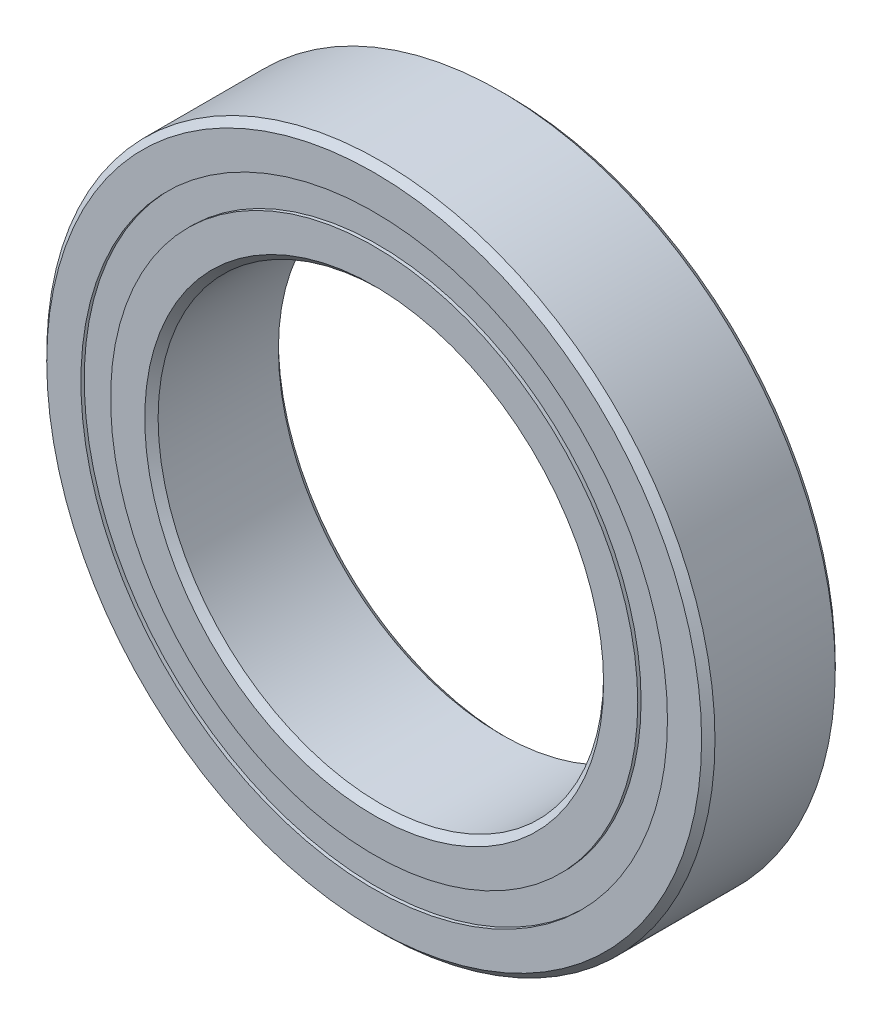
ISO-10303-21;
HEADER;
FILE_DESCRIPTION(('STEP AP214'),'2;1');
FILE_NAME('part.step','',(''),(''),'','','');
FILE_SCHEMA(('AUTOMOTIVE_DESIGN { 1 0 10303 214 1 1 1 1 }'));
ENDSEC;
DATA;
#1=APPLICATION_CONTEXT('core data for automotive mechanical design processes');
#2=APPLICATION_PROTOCOL_DEFINITION('international standard','automotive_design',2000,#1);
#3=PRODUCT_CONTEXT('',#1,'mechanical');
#4=PRODUCT('Part','Part','',(#3));
#5=PRODUCT_RELATED_PRODUCT_CATEGORY('part','',(#4));
#6=PRODUCT_DEFINITION_FORMATION('','',#4);
#7=PRODUCT_DEFINITION_CONTEXT('part definition',#1,'design');
#8=PRODUCT_DEFINITION('design','',#6,#7);
#9=PRODUCT_DEFINITION_SHAPE('','',#8);
#10=(LENGTH_UNIT() NAMED_UNIT(*) SI_UNIT(.MILLI.,.METRE.));
#11=(NAMED_UNIT(*) PLANE_ANGLE_UNIT() SI_UNIT($,.RADIAN.));
#12=(NAMED_UNIT(*) SI_UNIT($,.STERADIAN.) SOLID_ANGLE_UNIT());
#13=UNCERTAINTY_MEASURE_WITH_UNIT(LENGTH_MEASURE(1.E-05),#10,'distance_accuracy_value','');
#14=(GEOMETRIC_REPRESENTATION_CONTEXT(3) GLOBAL_UNCERTAINTY_ASSIGNED_CONTEXT((#13)) GLOBAL_UNIT_ASSIGNED_CONTEXT((#10,
#11,#12)) REPRESENTATION_CONTEXT('',''));
#15=CARTESIAN_POINT('',(0.,0.,0.));
#16=DIRECTION('',(0.,0.,1.));
#17=DIRECTION('',(1.,0.,0.));
#18=AXIS2_PLACEMENT_3D('',#15,#16,#17);
#19=CARTESIAN_POINT('',(0.,6.58333333333333,-0.745355992499933));
#20=DIRECTION('',(0.,0.,-1.));
#21=DIRECTION('',(-1.,0.,0.));
#22=AXIS2_PLACEMENT_3D('',#19,#20,#21);
#23=PLANE('',#22);
#24=CARTESIAN_POINT('',(0.,0.,-0.745355992499933));
#25=DIRECTION('',(0.,0.,1.));
#26=DIRECTION('',(1.,0.,0.));
#27=AXIS2_PLACEMENT_3D('',#24,#25,#26);
#28=CIRCLE('',#27,5.91666666666667);
#29=CARTESIAN_POINT('',(5.91666666666667,0.,-0.745355992499933));
#30=VERTEX_POINT('',#29);
#31=EDGE_CURVE('E11',#30,#30,#28,.T.);
#32=ORIENTED_EDGE('',*,*,#31,.F.);
#33=EDGE_LOOP('',(#32));
#34=FACE_BOUND('',#33,.T.);
#35=CARTESIAN_POINT('',(0.,0.,-0.745355992499933));
#36=DIRECTION('',(0.,0.,1.));
#37=DIRECTION('',(1.,0.,0.));
#38=AXIS2_PLACEMENT_3D('',#35,#36,#37);
#39=CIRCLE('',#38,6.58333333333333);
#40=CARTESIAN_POINT('',(6.58333333333333,0.,-0.745355992499933));
#41=VERTEX_POINT('',#40);
#42=EDGE_CURVE('E60',#41,#41,#39,.T.);
#43=ORIENTED_EDGE('',*,*,#42,.T.);
#44=EDGE_LOOP('',(#43));
#45=FACE_BOUND('',#44,.T.);
#46=ADVANCED_FACE('F46',(#34,#45),#23,.F.);
#47=CARTESIAN_POINT('',(0.,0.,1.5));
#48=DIRECTION('',(0.,0.,1.));
#49=DIRECTION('',(1.,0.,0.));
#50=AXIS2_PLACEMENT_3D('',#47,#48,#49);
#51=CYLINDRICAL_SURFACE('',#50,5.91666666666667);
#52=CARTESIAN_POINT('',(0.,0.,-1.42500000000001));
#53=DIRECTION('',(0.,0.,1.));
#54=DIRECTION('',(1.,0.,0.));
#55=AXIS2_PLACEMENT_3D('',#52,#53,#54);
#56=CIRCLE('',#55,5.91666666666667);
#57=CARTESIAN_POINT('',(5.91666666666667,0.,-1.42500000000001));
#58=VERTEX_POINT('',#57);
#59=EDGE_CURVE('E52',#58,#58,#56,.T.);
#60=ORIENTED_EDGE('',*,*,#59,.F.);
#61=EDGE_LOOP('',(#60));
#62=FACE_BOUND('',#61,.T.);
#63=ORIENTED_EDGE('',*,*,#31,.T.);
#64=EDGE_LOOP('',(#63));
#65=FACE_BOUND('',#64,.T.);
#66=ADVANCED_FACE('F75',(#62,#65),#51,.F.);
#67=CARTESIAN_POINT('',(0.,6.58333333333333,-1.42500000000001));
#68=DIRECTION('',(0.,0.,1.));
#69=DIRECTION('',(1.,0.,0.));
#70=AXIS2_PLACEMENT_3D('',#67,#68,#69);
#71=PLANE('',#70);
#72=CARTESIAN_POINT('',(0.,0.,-1.42500000000001));
#73=DIRECTION('',(0.,0.,1.));
#74=DIRECTION('',(1.,0.,0.));
#75=AXIS2_PLACEMENT_3D('',#72,#73,#74);
#76=CIRCLE('',#75,6.58333333333333);
#77=CARTESIAN_POINT('',(6.58333333333333,0.,-1.42500000000001));
#78=VERTEX_POINT('',#77);
#79=EDGE_CURVE('E56',#78,#78,#76,.T.);
#80=ORIENTED_EDGE('',*,*,#79,.F.);
#81=EDGE_LOOP('',(#80));
#82=FACE_BOUND('',#81,.T.);
#83=ORIENTED_EDGE('',*,*,#59,.T.);
#84=EDGE_LOOP('',(#83));
#85=FACE_BOUND('',#84,.T.);
#86=ADVANCED_FACE('F70',(#82,#85),#71,.F.);
#87=CARTESIAN_POINT('',(0.,0.,1.5));
#88=DIRECTION('',(0.,0.,1.));
#89=DIRECTION('',(1.,0.,0.));
#90=AXIS2_PLACEMENT_3D('',#87,#88,#89);
#91=CYLINDRICAL_SURFACE('',#90,6.58333333333333);
#92=ORIENTED_EDGE('',*,*,#42,.F.);
#93=EDGE_LOOP('',(#92));
#94=FACE_BOUND('',#93,.T.);
#95=ORIENTED_EDGE('',*,*,#79,.T.);
#96=EDGE_LOOP('',(#95));
#97=FACE_BOUND('',#96,.T.);
#98=ADVANCED_FACE('F67',(#94,#97),#91,.T.);
#99=CLOSED_SHELL('',(#46,#66,#86,#98));
#100=MANIFOLD_SOLID_BREP('B2',#99);
#101=CARTESIAN_POINT('',(0.,6.58333333333333,1.425));
#102=DIRECTION('',(0.,0.,-1.));
#103=DIRECTION('',(-1.,0.,0.));
#104=AXIS2_PLACEMENT_3D('',#101,#102,#103);
#105=PLANE('',#104);
#106=CARTESIAN_POINT('',(0.,0.,1.425));
#107=DIRECTION('',(0.,0.,1.));
#108=DIRECTION('',(1.,0.,0.));
#109=AXIS2_PLACEMENT_3D('',#106,#107,#108);
#110=CIRCLE('',#109,5.91666666666667);
#111=CARTESIAN_POINT('',(5.91666666666667,0.,1.425));
#112=VERTEX_POINT('',#111);
#113=EDGE_CURVE('E45',#112,#112,#110,.T.);
#114=ORIENTED_EDGE('',*,*,#113,.F.);
#115=EDGE_LOOP('',(#114));
#116=FACE_BOUND('',#115,.T.);
#117=CARTESIAN_POINT('',(0.,0.,1.425));
#118=DIRECTION('',(0.,0.,1.));
#119=DIRECTION('',(1.,0.,0.));
#120=AXIS2_PLACEMENT_3D('',#117,#118,#119);
#121=CIRCLE('',#120,6.58333333333333);
#122=CARTESIAN_POINT('',(6.58333333333333,0.,1.425));
#123=VERTEX_POINT('',#122);
#124=EDGE_CURVE('E128',#123,#123,#121,.T.);
#125=ORIENTED_EDGE('',*,*,#124,.T.);
#126=EDGE_LOOP('',(#125));
#127=FACE_BOUND('',#126,.T.);
#128=ADVANCED_FACE('F114',(#116,#127),#105,.F.);
#129=CARTESIAN_POINT('',(0.,0.,1.5));
#130=DIRECTION('',(0.,0.,1.));
#131=DIRECTION('',(1.,0.,0.));
#132=AXIS2_PLACEMENT_3D('',#129,#130,#131);
#133=CYLINDRICAL_SURFACE('',#132,5.91666666666667);
#134=CARTESIAN_POINT('',(0.,0.,0.745355992499925));
#135=DIRECTION('',(0.,0.,1.));
#136=DIRECTION('',(1.,0.,0.));
#137=AXIS2_PLACEMENT_3D('',#134,#135,#136);
#138=CIRCLE('',#137,5.91666666666667);
#139=CARTESIAN_POINT('',(5.91666666666667,0.,0.745355992499925));
#140=VERTEX_POINT('',#139);
#141=EDGE_CURVE('E120',#140,#140,#138,.T.);
#142=ORIENTED_EDGE('',*,*,#141,.F.);
#143=EDGE_LOOP('',(#142));
#144=FACE_BOUND('',#143,.T.);
#145=ORIENTED_EDGE('',*,*,#113,.T.);
#146=EDGE_LOOP('',(#145));
#147=FACE_BOUND('',#146,.T.);
#148=ADVANCED_FACE('F143',(#144,#147),#133,.F.);
#149=CARTESIAN_POINT('',(0.,6.58333333333333,0.745355992499925));
#150=DIRECTION('',(0.,0.,1.));
#151=DIRECTION('',(1.,0.,0.));
#152=AXIS2_PLACEMENT_3D('',#149,#150,#151);
#153=PLANE('',#152);
#154=CARTESIAN_POINT('',(0.,0.,0.745355992499925));
#155=DIRECTION('',(0.,0.,1.));
#156=DIRECTION('',(1.,0.,0.));
#157=AXIS2_PLACEMENT_3D('',#154,#155,#156);
#158=CIRCLE('',#157,6.58333333333333);
#159=CARTESIAN_POINT('',(6.58333333333333,0.,0.745355992499925));
#160=VERTEX_POINT('',#159);
#161=EDGE_CURVE('E124',#160,#160,#158,.T.);
#162=ORIENTED_EDGE('',*,*,#161,.F.);
#163=EDGE_LOOP('',(#162));
#164=FACE_BOUND('',#163,.T.);
#165=ORIENTED_EDGE('',*,*,#141,.T.);
#166=EDGE_LOOP('',(#165));
#167=FACE_BOUND('',#166,.T.);
#168=ADVANCED_FACE('F138',(#164,#167),#153,.F.);
#169=CARTESIAN_POINT('',(0.,0.,1.5));
#170=DIRECTION('',(0.,0.,1.));
#171=DIRECTION('',(1.,0.,0.));
#172=AXIS2_PLACEMENT_3D('',#169,#170,#171);
#173=CYLINDRICAL_SURFACE('',#172,6.58333333333333);
#174=ORIENTED_EDGE('',*,*,#124,.F.);
#175=EDGE_LOOP('',(#174));
#176=FACE_BOUND('',#175,.T.);
#177=ORIENTED_EDGE('',*,*,#161,.T.);
#178=EDGE_LOOP('',(#177));
#179=FACE_BOUND('',#178,.T.);
#180=ADVANCED_FACE('F135',(#176,#179),#173,.T.);
#181=CLOSED_SHELL('',(#128,#148,#168,#180));
#182=MANIFOLD_SOLID_BREP('B6',#181);
#183=CARTESIAN_POINT('',(-1.55431179478026,6.05364475705397,0.));
#184=DIRECTION('',(0.,0.,1.));
#185=DIRECTION('',(-0.248689887164842,0.968583161128635,0.));
#186=AXIS2_PLACEMENT_3D('',#183,#184,#185);
#187=SPHERICAL_SURFACE('',#186,0.745355992499925);
#188=CARTESIAN_POINT('',(-1.55431179478026,6.05364475705397,0.745355992499921));
#189=VERTEX_POINT('',#188);
#190=VERTEX_LOOP('',#189);
#191=FACE_BOUND('',#190,.T.);
#192=ADVANCED_FACE('F182',(#191),#187,.T.);
#193=CLOSED_SHELL('',(#192));
#194=MANIFOLD_SOLID_BREP('B40',#193);
#195=CARTESIAN_POINT('',(-3.01096046313565,5.47691675027419,0.));
#196=DIRECTION('',(0.,0.,1.));
#197=DIRECTION('',(-0.481753674101704,0.87630668004387,0.));
#198=AXIS2_PLACEMENT_3D('',#195,#196,#197);
#199=SPHERICAL_SURFACE('',#198,0.745355992499925);
#200=CARTESIAN_POINT('',(-3.01096046313565,5.47691675027419,0.745355992499921));
#201=VERTEX_POINT('',#200);
#202=VERTEX_LOOP('',#201);
#203=FACE_BOUND('',#202,.T.);
#204=ADVANCED_FACE('F201',(#203),#199,.T.);
#205=CLOSED_SHELL('',(#204));
#206=MANIFOLD_SOLID_BREP('B110',#205);
#207=CARTESIAN_POINT('',(-4.27841941205425,4.55605392138388,0.));
#208=DIRECTION('',(0.,0.,1.));
#209=DIRECTION('',(-0.684547105928679,0.72896862742142,0.));
#210=AXIS2_PLACEMENT_3D('',#207,#208,#209);
#211=SPHERICAL_SURFACE('',#210,0.745355992499925);
#212=CARTESIAN_POINT('',(-4.27841941205425,4.55605392138388,0.745355992499921));
#213=VERTEX_POINT('',#212);
#214=VERTEX_LOOP('',#213);
#215=FACE_BOUND('',#214,.T.);
#216=ADVANCED_FACE('F220',(#215),#211,.T.);
#217=CLOSED_SHELL('',(#216));
#218=MANIFOLD_SOLID_BREP('B178',#217);
#219=CARTESIAN_POINT('',(-5.27704953438756,3.34891746861879,0.));
#220=DIRECTION('',(0.,0.,1.));
#221=DIRECTION('',(-0.844327925502009,0.535826794979007,0.));
#222=AXIS2_PLACEMENT_3D('',#219,#220,#221);
#223=SPHERICAL_SURFACE('',#222,0.745355992499925);
#224=CARTESIAN_POINT('',(-5.27704953438756,3.34891746861879,0.745355992499921));
#225=VERTEX_POINT('',#224);
#226=VERTEX_LOOP('',#225);
#227=FACE_BOUND('',#226,.T.);
#228=ADVANCED_FACE('F239',(#227),#223,.T.);
#229=CLOSED_SHELL('',(#228));
#230=MANIFOLD_SOLID_BREP('B197',#229);
#231=CARTESIAN_POINT('',(-5.94410322684469,1.93135621484349,0.));
#232=DIRECTION('',(0.,0.,1.));
#233=DIRECTION('',(-0.95105651629515,0.309016994374958,0.));
#234=AXIS2_PLACEMENT_3D('',#231,#232,#233);
#235=SPHERICAL_SURFACE('',#234,0.745355992499925);
#236=CARTESIAN_POINT('',(-5.94410322684469,1.93135621484349,0.745355992499921));
#237=VERTEX_POINT('',#236);
#238=VERTEX_LOOP('',#237);
#239=FACE_BOUND('',#238,.T.);
#240=ADVANCED_FACE('F258',(#239),#235,.T.);
#241=CLOSED_SHELL('',(#240));
#242=MANIFOLD_SOLID_BREP('B216',#241);
#243=CARTESIAN_POINT('',(-6.2376670526767,0.392440747058277,0.));
#244=DIRECTION('',(0.,0.,1.));
#245=DIRECTION('',(-0.998026728428271,0.0627905195293244,0.));
#246=AXIS2_PLACEMENT_3D('',#243,#244,#245);
#247=SPHERICAL_SURFACE('',#246,0.745355992499925);
#248=CARTESIAN_POINT('',(-6.2376670526767,0.392440747058277,0.745355992499921));
#249=VERTEX_POINT('',#248);
#250=VERTEX_LOOP('',#249);
#251=FACE_BOUND('',#250,.T.);
#252=ADVANCED_FACE('F277',(#251),#247,.T.);
#253=CLOSED_SHELL('',(#252));
#254=MANIFOLD_SOLID_BREP('B235',#253);
#255=CARTESIAN_POINT('',(-6.13929531705432,-1.17113321616072,0.));
#256=DIRECTION('',(0.,0.,1.));
#257=DIRECTION('',(-0.982287250728691,-0.187381314585715,0.));
#258=AXIS2_PLACEMENT_3D('',#255,#256,#257);
#259=SPHERICAL_SURFACE('',#258,0.745355992499925);
#260=CARTESIAN_POINT('',(-6.13929531705432,-1.17113321616072,0.745355992499921));
#261=VERTEX_POINT('',#260);
#262=VERTEX_LOOP('',#261);
#263=FACE_BOUND('',#262,.T.);
#264=ADVANCED_FACE('F296',(#263),#259,.T.);
#265=CLOSED_SHELL('',(#264));
#266=MANIFOLD_SOLID_BREP('B254',#265);
#267=CARTESIAN_POINT('',(-5.65516907791265,-2.66112057228165,0.));
#268=DIRECTION('',(0.,0.,1.));
#269=DIRECTION('',(-0.904827052466024,-0.425779291565064,0.));
#270=AXIS2_PLACEMENT_3D('',#267,#268,#269);
#271=SPHERICAL_SURFACE('',#270,0.745355992499925);
#272=CARTESIAN_POINT('',(-5.65516907791265,-2.66112057228165,0.745355992499921));
#273=VERTEX_POINT('',#272);
#274=VERTEX_LOOP('',#273);
#275=FACE_BOUND('',#274,.T.);
#276=ADVANCED_FACE('F315',(#275),#271,.T.);
#277=CLOSED_SHELL('',(#276));
#278=MANIFOLD_SOLID_BREP('B273',#277);
#279=CARTESIAN_POINT('',(-4.81570776734872,-3.98389993592927,0.));
#280=DIRECTION('',(0.,0.,1.));
#281=DIRECTION('',(-0.770513242775795,-0.637423989748683,0.));
#282=AXIS2_PLACEMENT_3D('',#279,#280,#281);
#283=SPHERICAL_SURFACE('',#282,0.745355992499925);
#284=CARTESIAN_POINT('',(-4.81570776734872,-3.98389993592927,0.745355992499921));
#285=VERTEX_POINT('',#284);
#286=VERTEX_LOOP('',#285);
#287=FACE_BOUND('',#286,.T.);
#288=ADVANCED_FACE('F334',(#287),#283,.T.);
#289=CLOSED_SHELL('',(#288));
#290=MANIFOLD_SOLID_BREP('B292',#289);
#291=CARTESIAN_POINT('',(-3.673657826828,-5.05635621484339,0.));
#292=DIRECTION('',(0.,0.,1.));
#293=DIRECTION('',(-0.58778525229248,-0.809016994374942,0.));
#294=AXIS2_PLACEMENT_3D('',#291,#292,#293);
#295=SPHERICAL_SURFACE('',#294,0.745355992499925);
#296=CARTESIAN_POINT('',(-3.673657826828,-5.05635621484339,0.745355992499921));
#297=VERTEX_POINT('',#296);
#298=VERTEX_LOOP('',#297);
#299=FACE_BOUND('',#298,.T.);
#300=ADVANCED_FACE('F353',(#299),#295,.T.);
#301=CLOSED_SHELL('',(#300));
#302=MANIFOLD_SOLID_BREP('B311',#301);
#303=CARTESIAN_POINT('',(-2.30077845427928,-5.81110303680155,0.));
#304=DIRECTION('',(0.,0.,1.));
#305=DIRECTION('',(-0.368124552684685,-0.929776485888248,0.));
#306=AXIS2_PLACEMENT_3D('',#303,#304,#305);
#307=SPHERICAL_SURFACE('',#306,0.745355992499925);
#308=CARTESIAN_POINT('',(-2.30077845427928,-5.81110303680155,0.745355992499921));
#309=VERTEX_POINT('',#308);
#310=VERTEX_LOOP('',#309);
#311=FACE_BOUND('',#310,.T.);
#312=ADVANCED_FACE('F387',(#311),#307,.T.);
#313=CLOSED_SHELL('',(#312));
#314=MANIFOLD_SOLID_BREP('B330',#313);
#315=CARTESIAN_POINT('',(-0.783332709776946,-6.20071688321548,0.));
#316=DIRECTION('',(0.,0.,1.));
#317=DIRECTION('',(-0.125333233564311,-0.992114701314477,0.));
#318=AXIS2_PLACEMENT_3D('',#315,#316,#317);
#319=SPHERICAL_SURFACE('',#318,0.745355992499925);
#320=CARTESIAN_POINT('',(-0.783332709776946,-6.20071688321548,0.745355992499921));
#321=VERTEX_POINT('',#320);
#322=VERTEX_LOOP('',#321);
#323=FACE_BOUND('',#322,.T.);
#324=ADVANCED_FACE('F421',(#323),#319,.T.);
#325=CLOSED_SHELL('',(#324));
#326=MANIFOLD_SOLID_BREP('B349',#325);
#327=CARTESIAN_POINT('',(0.78333270977686,-6.20071688321549,0.));
#328=DIRECTION('',(0.,0.,1.));
#329=DIRECTION('',(0.125333233564297,-0.992114701314479,0.));
#330=AXIS2_PLACEMENT_3D('',#327,#328,#329);
#331=SPHERICAL_SURFACE('',#330,0.745355992499925);
#332=CARTESIAN_POINT('',(0.78333270977686,-6.20071688321549,0.745355992499921));
#333=VERTEX_POINT('',#332);
#334=VERTEX_LOOP('',#333);
#335=FACE_BOUND('',#334,.T.);
#336=ADVANCED_FACE('F455',(#335),#331,.T.);
#337=CLOSED_SHELL('',(#336));
#338=MANIFOLD_SOLID_BREP('B383',#337);
#339=CARTESIAN_POINT('',(2.3007784542792,-5.81110303680159,0.));
#340=DIRECTION('',(0.,0.,1.));
#341=DIRECTION('',(0.368124552684672,-0.929776485888254,0.));
#342=AXIS2_PLACEMENT_3D('',#339,#340,#341);
#343=SPHERICAL_SURFACE('',#342,0.745355992499925);
#344=CARTESIAN_POINT('',(2.3007784542792,-5.81110303680159,0.745355992499921));
#345=VERTEX_POINT('',#344);
#346=VERTEX_LOOP('',#345);
#347=FACE_BOUND('',#346,.T.);
#348=ADVANCED_FACE('F489',(#347),#343,.T.);
#349=CLOSED_SHELL('',(#348));
#350=MANIFOLD_SOLID_BREP('B417',#349);
#351=CARTESIAN_POINT('',(3.67365782682793,-5.05635621484344,0.));
#352=DIRECTION('',(0.,0.,1.));
#353=DIRECTION('',(0.587785252292469,-0.809016994374951,0.));
#354=AXIS2_PLACEMENT_3D('',#351,#352,#353);
#355=SPHERICAL_SURFACE('',#354,0.745355992499925);
#356=CARTESIAN_POINT('',(3.67365782682793,-5.05635621484344,0.745355992499921));
#357=VERTEX_POINT('',#356);
#358=VERTEX_LOOP('',#357);
#359=FACE_BOUND('',#358,.T.);
#360=ADVANCED_FACE('F523',(#359),#355,.T.);
#361=CLOSED_SHELL('',(#360));
#362=MANIFOLD_SOLID_BREP('B451',#361);
#363=CARTESIAN_POINT('',(4.81570776734867,-3.98389993592934,0.));
#364=DIRECTION('',(0.,0.,1.));
#365=DIRECTION('',(0.770513242775786,-0.637423989748694,0.));
#366=AXIS2_PLACEMENT_3D('',#363,#364,#365);
#367=SPHERICAL_SURFACE('',#366,0.745355992499925);
#368=CARTESIAN_POINT('',(4.81570776734867,-3.98389993592934,0.745355992499921));
#369=VERTEX_POINT('',#368);
#370=VERTEX_LOOP('',#369);
#371=FACE_BOUND('',#370,.T.);
#372=ADVANCED_FACE('F557',(#371),#367,.T.);
#373=CLOSED_SHELL('',(#372));
#374=MANIFOLD_SOLID_BREP('B485',#373);
#375=CARTESIAN_POINT('',(5.65516907791261,-2.66112057228173,0.));
#376=DIRECTION('',(0.,0.,1.));
#377=DIRECTION('',(0.904827052466018,-0.425779291565077,0.));
#378=AXIS2_PLACEMENT_3D('',#375,#376,#377);
#379=SPHERICAL_SURFACE('',#378,0.745355992499925);
#380=CARTESIAN_POINT('',(5.65516907791261,-2.66112057228173,0.745355992499921));
#381=VERTEX_POINT('',#380);
#382=VERTEX_LOOP('',#381);
#383=FACE_BOUND('',#382,.T.);
#384=ADVANCED_FACE('F591',(#383),#379,.T.);
#385=CLOSED_SHELL('',(#384));
#386=MANIFOLD_SOLID_BREP('B519',#385);
#387=CARTESIAN_POINT('',(6.1392953170543,-1.1711332161608,0.));
#388=DIRECTION('',(0.,0.,1.));
#389=DIRECTION('',(0.982287250728688,-0.187381314585729,0.));
#390=AXIS2_PLACEMENT_3D('',#387,#388,#389);
#391=SPHERICAL_SURFACE('',#390,0.745355992499925);
#392=CARTESIAN_POINT('',(6.1392953170543,-1.1711332161608,0.745355992499921));
#393=VERTEX_POINT('',#392);
#394=VERTEX_LOOP('',#393);
#395=FACE_BOUND('',#394,.T.);
#396=ADVANCED_FACE('F625',(#395),#391,.T.);
#397=CLOSED_SHELL('',(#396));
#398=MANIFOLD_SOLID_BREP('B553',#397);
#399=CARTESIAN_POINT('',(6.2376670526767,0.392440747058187,0.));
#400=DIRECTION('',(0.,0.,1.));
#401=DIRECTION('',(0.998026728428272,0.06279051952931,0.));
#402=AXIS2_PLACEMENT_3D('',#399,#400,#401);
#403=SPHERICAL_SURFACE('',#402,0.745355992499925);
#404=CARTESIAN_POINT('',(6.2376670526767,0.392440747058187,0.745355992499921));
#405=VERTEX_POINT('',#404);
#406=VERTEX_LOOP('',#405);
#407=FACE_BOUND('',#406,.T.);
#408=ADVANCED_FACE('F659',(#407),#403,.T.);
#409=CLOSED_SHELL('',(#408));
#410=MANIFOLD_SOLID_BREP('B587',#409);
#411=CARTESIAN_POINT('',(5.94410322684472,1.93135621484341,0.));
#412=DIRECTION('',(0.,0.,1.));
#413=DIRECTION('',(0.951056516295155,0.309016994374945,0.));
#414=AXIS2_PLACEMENT_3D('',#411,#412,#413);
#415=SPHERICAL_SURFACE('',#414,0.745355992499925);
#416=CARTESIAN_POINT('',(5.94410322684472,1.93135621484341,0.745355992499921));
#417=VERTEX_POINT('',#416);
#418=VERTEX_LOOP('',#417);
#419=FACE_BOUND('',#418,.T.);
#420=ADVANCED_FACE('F693',(#419),#415,.T.);
#421=CLOSED_SHELL('',(#420));
#422=MANIFOLD_SOLID_BREP('B621',#421);
#423=CARTESIAN_POINT('',(5.27704953438761,3.34891746861872,0.));
#424=DIRECTION('',(0.,0.,1.));
#425=DIRECTION('',(0.844327925502017,0.535826794978995,0.));
#426=AXIS2_PLACEMENT_3D('',#423,#424,#425);
#427=SPHERICAL_SURFACE('',#426,0.745355992499925);
#428=CARTESIAN_POINT('',(5.27704953438761,3.34891746861872,0.745355992499921));
#429=VERTEX_POINT('',#428);
#430=VERTEX_LOOP('',#429);
#431=FACE_BOUND('',#430,.T.);
#432=ADVANCED_FACE('F727',(#431),#427,.T.);
#433=CLOSED_SHELL('',(#432));
#434=MANIFOLD_SOLID_BREP('B655',#433);
#435=CARTESIAN_POINT('',(4.27841941205431,4.55605392138382,0.));
#436=DIRECTION('',(0.,0.,1.));
#437=DIRECTION('',(0.68454710592869,0.72896862742141,0.));
#438=AXIS2_PLACEMENT_3D('',#435,#436,#437);
#439=SPHERICAL_SURFACE('',#438,0.745355992499925);
#440=CARTESIAN_POINT('',(4.27841941205431,4.55605392138382,0.745355992499921));
#441=VERTEX_POINT('',#440);
#442=VERTEX_LOOP('',#441);
#443=FACE_BOUND('',#442,.T.);
#444=ADVANCED_FACE('F761',(#443),#439,.T.);
#445=CLOSED_SHELL('',(#444));
#446=MANIFOLD_SOLID_BREP('B689',#445);
#447=CARTESIAN_POINT('',(3.01096046313573,5.47691675027415,0.));
#448=DIRECTION('',(0.,0.,1.));
#449=DIRECTION('',(0.481753674101716,0.876306680043863,0.));
#450=AXIS2_PLACEMENT_3D('',#447,#448,#449);
#451=SPHERICAL_SURFACE('',#450,0.745355992499925);
#452=CARTESIAN_POINT('',(3.01096046313573,5.47691675027415,0.745355992499921));
#453=VERTEX_POINT('',#452);
#454=VERTEX_LOOP('',#453);
#455=FACE_BOUND('',#454,.T.);
#456=ADVANCED_FACE('F795',(#455),#451,.T.);
#457=CLOSED_SHELL('',(#456));
#458=MANIFOLD_SOLID_BREP('B723',#457);
#459=CARTESIAN_POINT('',(1.55431179478035,6.05364475705395,0.));
#460=DIRECTION('',(0.,0.,1.));
#461=DIRECTION('',(0.248689887164855,0.968583161128631,0.));
#462=AXIS2_PLACEMENT_3D('',#459,#460,#461);
#463=SPHERICAL_SURFACE('',#462,0.745355992499925);
#464=CARTESIAN_POINT('',(1.55431179478035,6.05364475705395,0.745355992499921));
#465=VERTEX_POINT('',#464);
#466=VERTEX_LOOP('',#465);
#467=FACE_BOUND('',#466,.T.);
#468=ADVANCED_FACE('F829',(#467),#463,.T.);
#469=CLOSED_SHELL('',(#468));
#470=MANIFOLD_SOLID_BREP('B757',#469);
#471=CARTESIAN_POINT('',(0.,6.25,0.));
#472=DIRECTION('',(0.,0.,1.));
#473=DIRECTION('',(0.,1.,0.));
#474=AXIS2_PLACEMENT_3D('',#471,#472,#473);
#475=SPHERICAL_SURFACE('',#474,0.745355992499925);
#476=CARTESIAN_POINT('',(0.,6.25,0.745355992499921));
#477=VERTEX_POINT('',#476);
#478=VERTEX_LOOP('',#477);
#479=FACE_BOUND('',#478,.T.);
#480=ADVANCED_FACE('F865',(#479),#475,.T.);
#481=CLOSED_SHELL('',(#480));
#482=MANIFOLD_SOLID_BREP('B791',#481);
#483=CARTESIAN_POINT('',(0.,5.91666666666667,1.5));
#484=DIRECTION('',(0.,0.,-1.));
#485=DIRECTION('',(-1.,0.,0.));
#486=AXIS2_PLACEMENT_3D('',#483,#484,#485);
#487=PLANE('',#486);
#488=CARTESIAN_POINT('',(0.,0.,1.5));
#489=DIRECTION('',(0.,0.,1.));
#490=DIRECTION('',(1.,0.,0.));
#491=AXIS2_PLACEMENT_3D('',#488,#489,#490);
#492=CIRCLE('',#491,5.15);
#493=CARTESIAN_POINT('',(5.15,0.,1.5));
#494=VERTEX_POINT('',#493);
#495=EDGE_CURVE('E864',#494,#494,#492,.T.);
#496=ORIENTED_EDGE('',*,*,#495,.F.);
#497=EDGE_LOOP('',(#496));
#498=FACE_BOUND('',#497,.T.);
#499=CARTESIAN_POINT('',(0.,0.,1.5));
#500=DIRECTION('',(0.,0.,1.));
#501=DIRECTION('',(1.,0.,0.));
#502=AXIS2_PLACEMENT_3D('',#499,#500,#501);
#503=CIRCLE('',#502,5.91666666666667);
#504=CARTESIAN_POINT('',(5.91666666666667,0.,1.5));
#505=VERTEX_POINT('',#504);
#506=EDGE_CURVE('E913',#505,#505,#503,.T.);
#507=ORIENTED_EDGE('',*,*,#506,.T.);
#508=EDGE_LOOP('',(#507));
#509=FACE_BOUND('',#508,.T.);
#510=ADVANCED_FACE('F885',(#498,#509),#487,.F.);
#511=CARTESIAN_POINT('',(0.,0.,1.5));
#512=DIRECTION('',(0.,0.,1.));
#513=DIRECTION('',(1.,0.,0.));
#514=AXIS2_PLACEMENT_3D('',#511,#512,#513);
#515=CONICAL_SURFACE('',#514,5.15,0.78539816339744);
#516=CARTESIAN_POINT('',(0.,0.,1.35));
#517=DIRECTION('',(0.,0.,1.));
#518=DIRECTION('',(1.,0.,0.));
#519=AXIS2_PLACEMENT_3D('',#516,#517,#518);
#520=CIRCLE('',#519,5.);
#521=CARTESIAN_POINT('',(5.,0.,1.35));
#522=VERTEX_POINT('',#521);
#523=EDGE_CURVE('E891',#522,#522,#520,.T.);
#524=ORIENTED_EDGE('',*,*,#523,.F.);
#525=EDGE_LOOP('',(#524));
#526=FACE_BOUND('',#525,.T.);
#527=ORIENTED_EDGE('',*,*,#495,.T.);
#528=EDGE_LOOP('',(#527));
#529=FACE_BOUND('',#528,.T.);
#530=ADVANCED_FACE('F950',(#526,#529),#515,.F.);
#531=CARTESIAN_POINT('',(0.,0.,1.5));
#532=DIRECTION('',(0.,0.,1.));
#533=DIRECTION('',(1.,0.,0.));
#534=AXIS2_PLACEMENT_3D('',#531,#532,#533);
#535=CYLINDRICAL_SURFACE('',#534,5.);
#536=CARTESIAN_POINT('',(0.,0.,-1.35));
#537=DIRECTION('',(0.,0.,1.));
#538=DIRECTION('',(1.,0.,0.));
#539=AXIS2_PLACEMENT_3D('',#536,#537,#538);
#540=CIRCLE('',#539,5.);
#541=CARTESIAN_POINT('',(5.,0.,-1.35));
#542=VERTEX_POINT('',#541);
#543=EDGE_CURVE('E895',#542,#542,#540,.T.);
#544=ORIENTED_EDGE('',*,*,#543,.F.);
#545=EDGE_LOOP('',(#544));
#546=FACE_BOUND('',#545,.T.);
#547=ORIENTED_EDGE('',*,*,#523,.T.);
#548=EDGE_LOOP('',(#547));
#549=FACE_BOUND('',#548,.T.);
#550=ADVANCED_FACE('F945',(#546,#549),#535,.F.);
#551=CARTESIAN_POINT('',(0.,0.,-1.35));
#552=DIRECTION('',(0.,0.,-1.));
#553=DIRECTION('',(-1.,0.,0.));
#554=AXIS2_PLACEMENT_3D('',#551,#552,#553);
#555=CONICAL_SURFACE('',#554,5.,0.785398163397437);
#556=CARTESIAN_POINT('',(0.,0.,-1.5));
#557=DIRECTION('',(0.,0.,1.));
#558=DIRECTION('',(1.,0.,0.));
#559=AXIS2_PLACEMENT_3D('',#556,#557,#558);
#560=CIRCLE('',#559,5.15);
#561=CARTESIAN_POINT('',(5.15,0.,-1.5));
#562=VERTEX_POINT('',#561);
#563=EDGE_CURVE('E899',#562,#562,#560,.T.);
#564=ORIENTED_EDGE('',*,*,#563,.F.);
#565=EDGE_LOOP('',(#564));
#566=FACE_BOUND('',#565,.T.);
#567=ORIENTED_EDGE('',*,*,#543,.T.);
#568=EDGE_LOOP('',(#567));
#569=FACE_BOUND('',#568,.T.);
#570=ADVANCED_FACE('F939',(#566,#569),#555,.F.);
#571=CARTESIAN_POINT('',(0.,5.91666666666667,-1.5));
#572=DIRECTION('',(0.,0.,1.));
#573=DIRECTION('',(1.,0.,0.));
#574=AXIS2_PLACEMENT_3D('',#571,#572,#573);
#575=PLANE('',#574);
#576=CARTESIAN_POINT('',(0.,0.,-1.5));
#577=DIRECTION('',(0.,0.,1.));
#578=DIRECTION('',(1.,0.,0.));
#579=AXIS2_PLACEMENT_3D('',#576,#577,#578);
#580=CIRCLE('',#579,5.91666666666667);
#581=CARTESIAN_POINT('',(5.91666666666667,0.,-1.5));
#582=VERTEX_POINT('',#581);
#583=EDGE_CURVE('E904',#582,#582,#580,.T.);
#584=ORIENTED_EDGE('',*,*,#583,.F.);
#585=EDGE_LOOP('',(#584));
#586=FACE_BOUND('',#585,.T.);
#587=ORIENTED_EDGE('',*,*,#563,.T.);
#588=EDGE_LOOP('',(#587));
#589=FACE_BOUND('',#588,.T.);
#590=ADVANCED_FACE('F933',(#586,#589),#575,.F.);
#591=CARTESIAN_POINT('',(0.,0.,1.5));
#592=DIRECTION('',(0.,0.,1.));
#593=DIRECTION('',(1.,0.,0.));
#594=AXIS2_PLACEMENT_3D('',#591,#592,#593);
#595=CYLINDRICAL_SURFACE('',#594,5.91666666666667);
#596=CARTESIAN_POINT('',(0.,0.,-0.666666666666667));
#597=DIRECTION('',(0.,0.,1.));
#598=DIRECTION('',(1.,0.,0.));
#599=AXIS2_PLACEMENT_3D('',#596,#597,#598);
#600=CIRCLE('',#599,5.91666666666667);
#601=CARTESIAN_POINT('',(5.91666666666667,0.,-0.666666666666667));
#602=VERTEX_POINT('',#601);
#603=EDGE_CURVE('E907',#602,#602,#600,.T.);
#604=ORIENTED_EDGE('',*,*,#603,.F.);
#605=EDGE_LOOP('',(#604));
#606=FACE_BOUND('',#605,.T.);
#607=ORIENTED_EDGE('',*,*,#583,.T.);
#608=EDGE_LOOP('',(#607));
#609=FACE_BOUND('',#608,.T.);
#610=ADVANCED_FACE('F927',(#606,#609),#595,.T.);
#611=CARTESIAN_POINT('',(0.,0.,0.));
#612=DIRECTION('',(0.,0.,1.));
#613=DIRECTION('',(1.,0.,0.));
#614=AXIS2_PLACEMENT_3D('',#611,#612,#613);
#615=TOROIDAL_SURFACE('',#614,6.25,0.745355992499926);
#616=CARTESIAN_POINT('',(0.,0.,0.666666666666663));
#617=DIRECTION('',(0.,0.,1.));
#618=DIRECTION('',(1.,0.,0.));
#619=AXIS2_PLACEMENT_3D('',#616,#617,#618);
#620=CIRCLE('',#619,5.91666666666667);
#621=CARTESIAN_POINT('',(5.91666666666667,0.,0.666666666666663));
#622=VERTEX_POINT('',#621);
#623=EDGE_CURVE('E910',#622,#622,#620,.T.);
#624=ORIENTED_EDGE('',*,*,#623,.F.);
#625=EDGE_LOOP('',(#624));
#626=FACE_BOUND('',#625,.T.);
#627=ORIENTED_EDGE('',*,*,#603,.T.);
#628=EDGE_LOOP('',(#627));
#629=FACE_BOUND('',#628,.T.);
#630=ADVANCED_FACE('F921',(#626,#629),#615,.F.);
#631=CARTESIAN_POINT('',(0.,0.,1.5));
#632=DIRECTION('',(0.,0.,1.));
#633=DIRECTION('',(1.,0.,0.));
#634=AXIS2_PLACEMENT_3D('',#631,#632,#633);
#635=CYLINDRICAL_SURFACE('',#634,5.91666666666667);
#636=ORIENTED_EDGE('',*,*,#506,.F.);
#637=EDGE_LOOP('',(#636));
#638=FACE_BOUND('',#637,.T.);
#639=ORIENTED_EDGE('',*,*,#623,.T.);
#640=EDGE_LOOP('',(#639));
#641=FACE_BOUND('',#640,.T.);
#642=ADVANCED_FACE('F918',(#638,#641),#635,.T.);
#643=CLOSED_SHELL('',(#510,#530,#550,#570,#590,#610,#630,#642));
#644=MANIFOLD_SOLID_BREP('B825',#643);
#645=CARTESIAN_POINT('',(0.,0.,1.35));
#646=DIRECTION('',(0.,0.,-1.));
#647=DIRECTION('',(-1.,0.,0.));
#648=AXIS2_PLACEMENT_3D('',#645,#646,#647);
#649=CONICAL_SURFACE('',#648,7.5,0.785398163397451);
#650=CARTESIAN_POINT('',(0.,0.,1.5));
#651=DIRECTION('',(0.,0.,1.));
#652=DIRECTION('',(1.,0.,0.));
#653=AXIS2_PLACEMENT_3D('',#650,#651,#652);
#654=CIRCLE('',#653,7.35);
#655=CARTESIAN_POINT('',(7.35,0.,1.5));
#656=VERTEX_POINT('',#655);
#657=EDGE_CURVE('E1035',#656,#656,#654,.T.);
#658=ORIENTED_EDGE('',*,*,#657,.F.);
#659=EDGE_LOOP('',(#658));
#660=FACE_BOUND('',#659,.T.);
#661=CARTESIAN_POINT('',(0.,0.,1.35));
#662=DIRECTION('',(0.,0.,1.));
#663=DIRECTION('',(1.,0.,0.));
#664=AXIS2_PLACEMENT_3D('',#661,#662,#663);
#665=CIRCLE('',#664,7.5);
#666=CARTESIAN_POINT('',(7.5,0.,1.35));
#667=VERTEX_POINT('',#666);
#668=EDGE_CURVE('E884',#667,#667,#665,.T.);
#669=ORIENTED_EDGE('',*,*,#668,.T.);
#670=EDGE_LOOP('',(#669));
#671=FACE_BOUND('',#670,.T.);
#672=ADVANCED_FACE('F1007',(#660,#671),#649,.T.);
#673=CARTESIAN_POINT('',(0.,0.,1.5));
#674=DIRECTION('',(0.,0.,1.));
#675=DIRECTION('',(1.,0.,0.));
#676=AXIS2_PLACEMENT_3D('',#673,#674,#675);
#677=CYLINDRICAL_SURFACE('',#676,7.5);
#678=ORIENTED_EDGE('',*,*,#668,.F.);
#679=EDGE_LOOP('',(#678));
#680=FACE_BOUND('',#679,.T.);
#681=CARTESIAN_POINT('',(0.,0.,-1.35000000000001));
#682=DIRECTION('',(0.,0.,1.));
#683=DIRECTION('',(1.,0.,0.));
#684=AXIS2_PLACEMENT_3D('',#681,#682,#683);
#685=CIRCLE('',#684,7.5);
#686=CARTESIAN_POINT('',(7.5,0.,-1.35000000000001));
#687=VERTEX_POINT('',#686);
#688=EDGE_CURVE('E1013',#687,#687,#685,.T.);
#689=ORIENTED_EDGE('',*,*,#688,.T.);
#690=EDGE_LOOP('',(#689));
#691=FACE_BOUND('',#690,.T.);
#692=ADVANCED_FACE('F1042',(#680,#691),#677,.T.);
#693=CARTESIAN_POINT('',(0.,0.,-1.50000000000001));
#694=DIRECTION('',(0.,0.,1.));
#695=DIRECTION('',(1.,0.,0.));
#696=AXIS2_PLACEMENT_3D('',#693,#694,#695);
#697=CONICAL_SURFACE('',#696,7.35,0.785398163397451);
#698=ORIENTED_EDGE('',*,*,#688,.F.);
#699=EDGE_LOOP('',(#698));
#700=FACE_BOUND('',#699,.T.);
#701=CARTESIAN_POINT('',(0.,0.,-1.50000000000001));
#702=DIRECTION('',(0.,0.,1.));
#703=DIRECTION('',(1.,0.,0.));
#704=AXIS2_PLACEMENT_3D('',#701,#702,#703);
#705=CIRCLE('',#704,7.35);
#706=CARTESIAN_POINT('',(7.35,0.,-1.50000000000001));
#707=VERTEX_POINT('',#706);
#708=EDGE_CURVE('E1017',#707,#707,#705,.T.);
#709=ORIENTED_EDGE('',*,*,#708,.T.);
#710=EDGE_LOOP('',(#709));
#711=FACE_BOUND('',#710,.T.);
#712=ADVANCED_FACE('F1046',(#700,#711),#697,.T.);
#713=CARTESIAN_POINT('',(0.,7.35,-1.50000000000001));
#714=DIRECTION('',(0.,0.,1.));
#715=DIRECTION('',(1.,0.,0.));
#716=AXIS2_PLACEMENT_3D('',#713,#714,#715);
#717=PLANE('',#716);
#718=ORIENTED_EDGE('',*,*,#708,.F.);
#719=EDGE_LOOP('',(#718));
#720=FACE_BOUND('',#719,.T.);
#721=CARTESIAN_POINT('',(0.,0.,-1.50000000000001));
#722=DIRECTION('',(0.,0.,1.));
#723=DIRECTION('',(1.,0.,0.));
#724=AXIS2_PLACEMENT_3D('',#721,#722,#723);
#725=CIRCLE('',#724,6.58333333333333);
#726=CARTESIAN_POINT('',(6.58333333333333,0.,-1.50000000000001));
#727=VERTEX_POINT('',#726);
#728=EDGE_CURVE('E1021',#727,#727,#725,.T.);
#729=ORIENTED_EDGE('',*,*,#728,.T.);
#730=EDGE_LOOP('',(#729));
#731=FACE_BOUND('',#730,.T.);
#732=ADVANCED_FACE('F1051',(#720,#731),#717,.F.);
#733=CARTESIAN_POINT('',(0.,0.,1.5));
#734=DIRECTION('',(0.,0.,1.));
#735=DIRECTION('',(1.,0.,0.));
#736=AXIS2_PLACEMENT_3D('',#733,#734,#735);
#737=CYLINDRICAL_SURFACE('',#736,6.58333333333333);
#738=ORIENTED_EDGE('',*,*,#728,.F.);
#739=EDGE_LOOP('',(#738));
#740=FACE_BOUND('',#739,.T.);
#741=CARTESIAN_POINT('',(0.,0.,-0.66666666666667));
#742=DIRECTION('',(0.,0.,1.));
#743=DIRECTION('',(1.,0.,0.));
#744=AXIS2_PLACEMENT_3D('',#741,#742,#743);
#745=CIRCLE('',#744,6.58333333333333);
#746=CARTESIAN_POINT('',(6.58333333333333,0.,-0.66666666666667));
#747=VERTEX_POINT('',#746);
#748=EDGE_CURVE('E1026',#747,#747,#745,.T.);
#749=ORIENTED_EDGE('',*,*,#748,.T.);
#750=EDGE_LOOP('',(#749));
#751=FACE_BOUND('',#750,.T.);
#752=ADVANCED_FACE('F1057',(#740,#751),#737,.F.);
#753=CARTESIAN_POINT('',(0.,0.,0.));
#754=DIRECTION('',(0.,0.,1.));
#755=DIRECTION('',(1.,0.,0.));
#756=AXIS2_PLACEMENT_3D('',#753,#754,#755);
#757=TOROIDAL_SURFACE('',#756,6.25,0.745355992499929);
#758=ORIENTED_EDGE('',*,*,#748,.F.);
#759=EDGE_LOOP('',(#758));
#760=FACE_BOUND('',#759,.T.);
#761=CARTESIAN_POINT('',(0.,0.,0.666666666666663));
#762=DIRECTION('',(0.,0.,1.));
#763=DIRECTION('',(1.,0.,0.));
#764=AXIS2_PLACEMENT_3D('',#761,#762,#763);
#765=CIRCLE('',#764,6.58333333333333);
#766=CARTESIAN_POINT('',(6.58333333333333,0.,0.666666666666663));
#767=VERTEX_POINT('',#766);
#768=EDGE_CURVE('E1029',#767,#767,#765,.T.);
#769=ORIENTED_EDGE('',*,*,#768,.T.);
#770=EDGE_LOOP('',(#769));
#771=FACE_BOUND('',#770,.T.);
#772=ADVANCED_FACE('F1061',(#760,#771),#757,.F.);
#773=CARTESIAN_POINT('',(0.,0.,1.5));
#774=DIRECTION('',(0.,0.,1.));
#775=DIRECTION('',(1.,0.,0.));
#776=AXIS2_PLACEMENT_3D('',#773,#774,#775);
#777=CYLINDRICAL_SURFACE('',#776,6.58333333333333);
#778=ORIENTED_EDGE('',*,*,#768,.F.);
#779=EDGE_LOOP('',(#778));
#780=FACE_BOUND('',#779,.T.);
#781=CARTESIAN_POINT('',(0.,0.,1.5));
#782=DIRECTION('',(0.,0.,1.));
#783=DIRECTION('',(1.,0.,0.));
#784=AXIS2_PLACEMENT_3D('',#781,#782,#783);
#785=CIRCLE('',#784,6.58333333333333);
#786=CARTESIAN_POINT('',(6.58333333333333,0.,1.5));
#787=VERTEX_POINT('',#786);
#788=EDGE_CURVE('E1032',#787,#787,#785,.T.);
#789=ORIENTED_EDGE('',*,*,#788,.T.);
#790=EDGE_LOOP('',(#789));
#791=FACE_BOUND('',#790,.T.);
#792=ADVANCED_FACE('F1065',(#780,#791),#777,.F.);
#793=CARTESIAN_POINT('',(0.,7.35,1.5));
#794=DIRECTION('',(0.,0.,-1.));
#795=DIRECTION('',(-1.,0.,0.));
#796=AXIS2_PLACEMENT_3D('',#793,#794,#795);
#797=PLANE('',#796);
#798=ORIENTED_EDGE('',*,*,#788,.F.);
#799=EDGE_LOOP('',(#798));
#800=FACE_BOUND('',#799,.T.);
#801=ORIENTED_EDGE('',*,*,#657,.T.);
#802=EDGE_LOOP('',(#801));
#803=FACE_BOUND('',#802,.T.);
#804=ADVANCED_FACE('F1039',(#800,#803),#797,.F.);
#805=CLOSED_SHELL('',(#672,#692,#712,#732,#752,#772,#792,#804));
#806=MANIFOLD_SOLID_BREP('B859',#805);
#807=ADVANCED_BREP_SHAPE_REPRESENTATION('',(#18,#100,#182,#194,#206,#218,#230,#242,#254,#266,
#278,#290,#302,#314,#326,#338,#350,#362,#374,#386,#398,#410,#422,#434,#446,#458,#470,#482,#644,
#806),#14);
#808=SHAPE_DEFINITION_REPRESENTATION(#9,#807);
ENDSEC;
END-ISO-10303-21;
